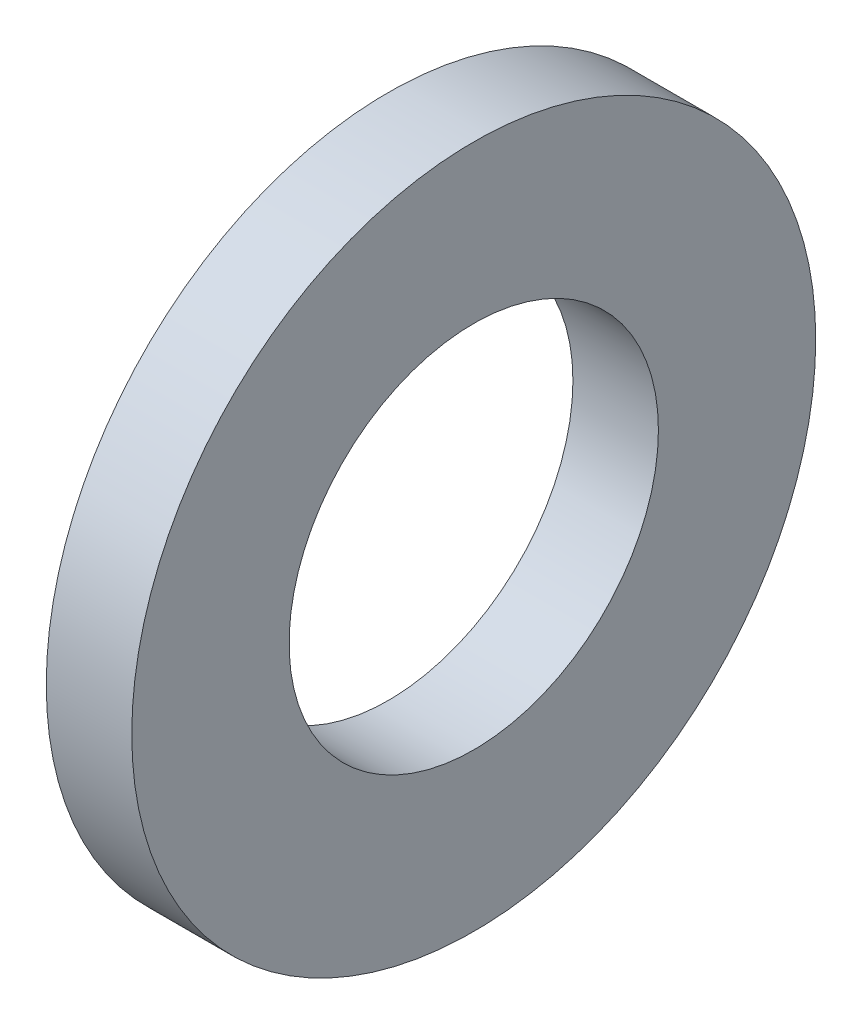
ISO-10303-21;
HEADER;
FILE_DESCRIPTION(('STEP AP214'),'2;1');
FILE_NAME('part.step','',(''),(''),'','','');
FILE_SCHEMA(('AUTOMOTIVE_DESIGN { 1 0 10303 214 1 1 1 1 }'));
ENDSEC;
DATA;
#1=APPLICATION_CONTEXT('core data for automotive mechanical design processes');
#2=APPLICATION_PROTOCOL_DEFINITION('international standard','automotive_design',2000,#1);
#3=PRODUCT_CONTEXT('',#1,'mechanical');
#4=PRODUCT('Part','Part','',(#3));
#5=PRODUCT_RELATED_PRODUCT_CATEGORY('part','',(#4));
#6=PRODUCT_DEFINITION_FORMATION('','',#4);
#7=PRODUCT_DEFINITION_CONTEXT('part definition',#1,'design');
#8=PRODUCT_DEFINITION('design','',#6,#7);
#9=PRODUCT_DEFINITION_SHAPE('','',#8);
#10=(LENGTH_UNIT() NAMED_UNIT(*) SI_UNIT(.MILLI.,.METRE.));
#11=(NAMED_UNIT(*) PLANE_ANGLE_UNIT() SI_UNIT($,.RADIAN.));
#12=(NAMED_UNIT(*) SI_UNIT($,.STERADIAN.) SOLID_ANGLE_UNIT());
#13=UNCERTAINTY_MEASURE_WITH_UNIT(LENGTH_MEASURE(1.E-05),#10,'distance_accuracy_value','');
#14=(GEOMETRIC_REPRESENTATION_CONTEXT(3) GLOBAL_UNCERTAINTY_ASSIGNED_CONTEXT((#13)) GLOBAL_UNIT_ASSIGNED_CONTEXT((#10,
#11,#12)) REPRESENTATION_CONTEXT('',''));
#15=CARTESIAN_POINT('',(0.,0.,0.));
#16=DIRECTION('',(0.,0.,1.));
#17=DIRECTION('',(1.,0.,0.));
#18=AXIS2_PLACEMENT_3D('',#15,#16,#17);
#19=CARTESIAN_POINT('',(-10.838635399,0.,0.));
#20=DIRECTION('',(1.,0.,0.));
#21=DIRECTION('',(0.,0.,-1.));
#22=AXIS2_PLACEMENT_3D('',#19,#20,#21);
#23=CYLINDRICAL_SURFACE('',#22,6.35);
#24=CARTESIAN_POINT('',(-9.251135399,0.,0.));
#25=DIRECTION('',(1.,0.,0.));
#26=DIRECTION('',(0.,0.,-1.));
#27=AXIS2_PLACEMENT_3D('',#24,#25,#26);
#28=CIRCLE('',#27,6.35);
#29=CARTESIAN_POINT('',(-9.251135399,0.,-6.35));
#30=VERTEX_POINT('',#29);
#31=EDGE_CURVE('E31',#30,#30,#28,.T.);
#32=ORIENTED_EDGE('',*,*,#31,.F.);
#33=EDGE_LOOP('',(#32));
#34=FACE_BOUND('',#33,.T.);
#35=CARTESIAN_POINT('',(-10.838635399,0.,0.));
#36=DIRECTION('',(1.,0.,0.));
#37=DIRECTION('',(0.,0.,-1.));
#38=AXIS2_PLACEMENT_3D('',#35,#36,#37);
#39=CIRCLE('',#38,6.35);
#40=CARTESIAN_POINT('',(-10.838635399,0.,-6.35));
#41=VERTEX_POINT('',#40);
#42=EDGE_CURVE('E18',#41,#41,#39,.F.);
#43=ORIENTED_EDGE('',*,*,#42,.F.);
#44=EDGE_LOOP('',(#43));
#45=FACE_BOUND('',#44,.T.);
#46=ADVANCED_FACE('F14',(#34,#45),#23,.T.);
#47=CARTESIAN_POINT('',(-10.838635399,-6.4262,-6.4262));
#48=DIRECTION('',(-1.,0.,0.));
#49=DIRECTION('',(0.,0.,1.));
#50=AXIS2_PLACEMENT_3D('',#47,#48,#49);
#51=PLANE('',#50);
#52=CARTESIAN_POINT('',(-10.838635399,0.,0.));
#53=DIRECTION('',(1.,0.,0.));
#54=DIRECTION('',(0.,0.,-1.));
#55=AXIS2_PLACEMENT_3D('',#52,#53,#54);
#56=CIRCLE('',#55,3.429);
#57=CARTESIAN_POINT('',(-10.838635399,0.,-3.429));
#58=VERTEX_POINT('',#57);
#59=EDGE_CURVE('E23',#58,#58,#56,.F.);
#60=ORIENTED_EDGE('',*,*,#59,.F.);
#61=EDGE_LOOP('',(#60));
#62=FACE_BOUND('',#61,.T.);
#63=ORIENTED_EDGE('',*,*,#42,.T.);
#64=EDGE_LOOP('',(#63));
#65=FACE_BOUND('',#64,.T.);
#66=ADVANCED_FACE('F40',(#62,#65),#51,.T.);
#67=CARTESIAN_POINT('',(-9.251135399,-6.4262,6.4262));
#68=DIRECTION('',(1.,0.,0.));
#69=DIRECTION('',(0.,0.,-1.));
#70=AXIS2_PLACEMENT_3D('',#67,#68,#69);
#71=PLANE('',#70);
#72=CARTESIAN_POINT('',(-9.251135399,0.,0.));
#73=DIRECTION('',(1.,0.,0.));
#74=DIRECTION('',(0.,0.,-1.));
#75=AXIS2_PLACEMENT_3D('',#72,#73,#74);
#76=CIRCLE('',#75,3.429);
#77=CARTESIAN_POINT('',(-9.251135399,0.,-3.429));
#78=VERTEX_POINT('',#77);
#79=EDGE_CURVE('E10',#78,#78,#76,.T.);
#80=ORIENTED_EDGE('',*,*,#79,.F.);
#81=EDGE_LOOP('',(#80));
#82=FACE_BOUND('',#81,.T.);
#83=ORIENTED_EDGE('',*,*,#31,.T.);
#84=EDGE_LOOP('',(#83));
#85=FACE_BOUND('',#84,.T.);
#86=ADVANCED_FACE('F16',(#82,#85),#71,.T.);
#87=CARTESIAN_POINT('',(-10.838635399,0.,0.));
#88=DIRECTION('',(1.,0.,0.));
#89=DIRECTION('',(0.,0.,-1.));
#90=AXIS2_PLACEMENT_3D('',#87,#88,#89);
#91=CYLINDRICAL_SURFACE('',#90,3.429);
#92=ORIENTED_EDGE('',*,*,#59,.T.);
#93=EDGE_LOOP('',(#92));
#94=FACE_BOUND('',#93,.T.);
#95=ORIENTED_EDGE('',*,*,#79,.T.);
#96=EDGE_LOOP('',(#95));
#97=FACE_BOUND('',#96,.T.);
#98=ADVANCED_FACE('F51',(#94,#97),#91,.F.);
#99=CLOSED_SHELL('',(#46,#66,#86,#98));
#100=MANIFOLD_SOLID_BREP('B1',#99);
#101=ADVANCED_BREP_SHAPE_REPRESENTATION('',(#18,#100),#14);
#102=SHAPE_DEFINITION_REPRESENTATION(#9,#101);
ENDSEC;
END-ISO-10303-21;
